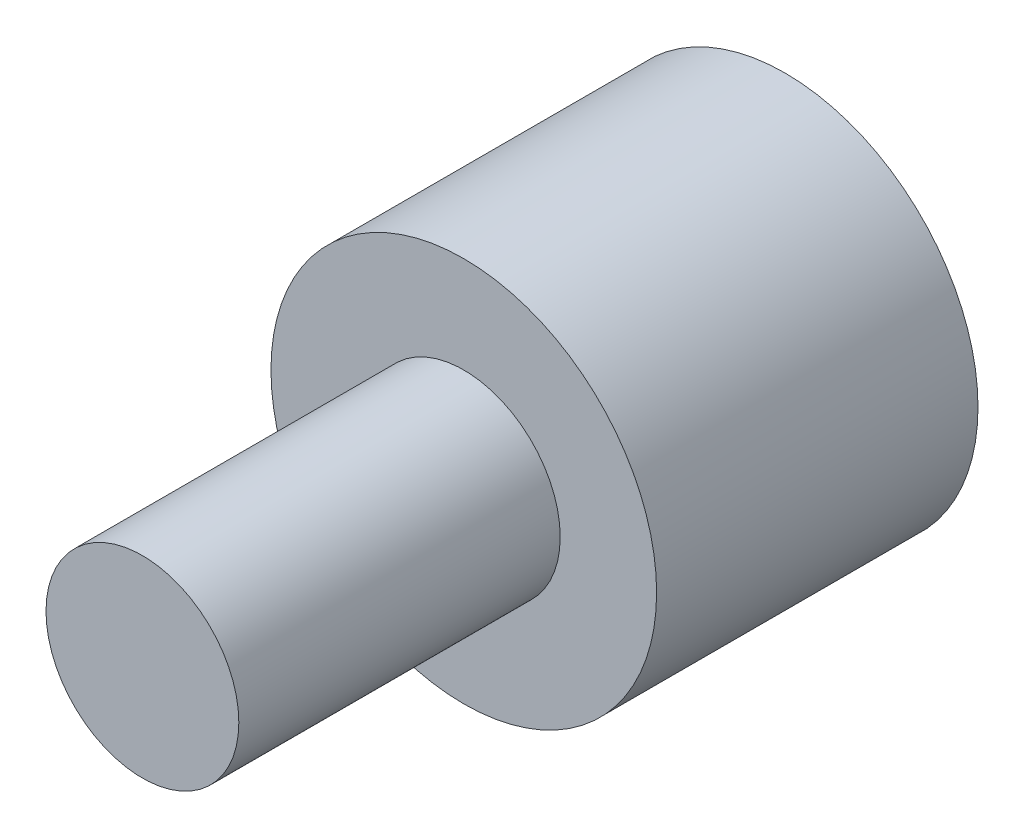
ISO-10303-21;
HEADER;
FILE_DESCRIPTION(('STEP AP214'),'2;1');
FILE_NAME('part.step','',(''),(''),'','','');
FILE_SCHEMA(('AUTOMOTIVE_DESIGN { 1 0 10303 214 1 1 1 1 }'));
ENDSEC;
DATA;
#1=APPLICATION_CONTEXT('core data for automotive mechanical design processes');
#2=APPLICATION_PROTOCOL_DEFINITION('international standard','automotive_design',2000,#1);
#3=PRODUCT_CONTEXT('',#1,'mechanical');
#4=PRODUCT('Part','Part','',(#3));
#5=PRODUCT_RELATED_PRODUCT_CATEGORY('part','',(#4));
#6=PRODUCT_DEFINITION_FORMATION('','',#4);
#7=PRODUCT_DEFINITION_CONTEXT('part definition',#1,'design');
#8=PRODUCT_DEFINITION('design','',#6,#7);
#9=PRODUCT_DEFINITION_SHAPE('','',#8);
#10=(LENGTH_UNIT() NAMED_UNIT(*) SI_UNIT(.MILLI.,.METRE.));
#11=(NAMED_UNIT(*) PLANE_ANGLE_UNIT() SI_UNIT($,.RADIAN.));
#12=(NAMED_UNIT(*) SI_UNIT($,.STERADIAN.) SOLID_ANGLE_UNIT());
#13=UNCERTAINTY_MEASURE_WITH_UNIT(LENGTH_MEASURE(1.E-05),#10,'distance_accuracy_value','');
#14=(GEOMETRIC_REPRESENTATION_CONTEXT(3) GLOBAL_UNCERTAINTY_ASSIGNED_CONTEXT((#13)) GLOBAL_UNIT_ASSIGNED_CONTEXT((#10,
#11,#12)) REPRESENTATION_CONTEXT('',''));
#15=CARTESIAN_POINT('',(0.,0.,0.));
#16=DIRECTION('',(0.,0.,1.));
#17=DIRECTION('',(1.,0.,0.));
#18=AXIS2_PLACEMENT_3D('',#15,#16,#17);
#19=CARTESIAN_POINT('',(0.,0.,20.));
#20=DIRECTION('',(0.,0.,-1.));
#21=DIRECTION('',(-1.,0.,0.));
#22=AXIS2_PLACEMENT_3D('',#19,#20,#21);
#23=CYLINDRICAL_SURFACE('',#22,12.);
#24=CARTESIAN_POINT('',(0.,0.,20.));
#25=DIRECTION('',(0.,0.,1.));
#26=DIRECTION('',(1.,0.,0.));
#27=AXIS2_PLACEMENT_3D('',#24,#25,#26);
#28=CIRCLE('',#27,12.);
#29=CARTESIAN_POINT('',(12.,0.,20.));
#30=VERTEX_POINT('',#29);
#31=EDGE_CURVE('E37',#30,#30,#28,.T.);
#32=ORIENTED_EDGE('',*,*,#31,.F.);
#33=EDGE_LOOP('',(#32));
#34=FACE_BOUND('',#33,.T.);
#35=CARTESIAN_POINT('',(0.,0.,0.));
#36=DIRECTION('',(0.,0.,1.));
#37=DIRECTION('',(1.,0.,0.));
#38=AXIS2_PLACEMENT_3D('',#35,#36,#37);
#39=CIRCLE('',#38,12.);
#40=CARTESIAN_POINT('',(12.,0.,0.));
#41=VERTEX_POINT('',#40);
#42=EDGE_CURVE('E33',#41,#41,#39,.T.);
#43=ORIENTED_EDGE('',*,*,#42,.T.);
#44=EDGE_LOOP('',(#43));
#45=FACE_BOUND('',#44,.T.);
#46=ADVANCED_FACE('F30',(#34,#45),#23,.T.);
#47=CARTESIAN_POINT('',(0.,0.,20.));
#48=DIRECTION('',(0.,0.,1.));
#49=DIRECTION('',(1.,0.,0.));
#50=AXIS2_PLACEMENT_3D('',#47,#48,#49);
#51=PLANE('',#50);
#52=CARTESIAN_POINT('',(0.,0.,20.));
#53=DIRECTION('',(0.,0.,1.));
#54=DIRECTION('',(1.,0.,0.));
#55=AXIS2_PLACEMENT_3D('',#52,#53,#54);
#56=CIRCLE('',#55,6.);
#57=CARTESIAN_POINT('',(6.,0.,20.));
#58=VERTEX_POINT('',#57);
#59=EDGE_CURVE('E10',#58,#58,#56,.T.);
#60=ORIENTED_EDGE('',*,*,#59,.F.);
#61=EDGE_LOOP('',(#60));
#62=FACE_BOUND('',#61,.T.);
#63=ORIENTED_EDGE('',*,*,#31,.T.);
#64=EDGE_LOOP('',(#63));
#65=FACE_BOUND('',#64,.T.);
#66=ADVANCED_FACE('F66',(#62,#65),#51,.T.);
#67=CARTESIAN_POINT('',(0.,0.,0.));
#68=DIRECTION('',(0.,0.,1.));
#69=DIRECTION('',(1.,0.,0.));
#70=AXIS2_PLACEMENT_3D('',#67,#68,#69);
#71=PLANE('',#70);
#72=CARTESIAN_POINT('',(0.,0.,0.));
#73=DIRECTION('',(0.,0.,-1.));
#74=DIRECTION('',(-1.,0.,0.));
#75=AXIS2_PLACEMENT_3D('',#72,#73,#74);
#76=CIRCLE('',#75,5.);
#77=CARTESIAN_POINT('',(-5.,0.,0.));
#78=VERTEX_POINT('',#77);
#79=EDGE_CURVE('E47',#78,#78,#76,.T.);
#80=ORIENTED_EDGE('',*,*,#79,.F.);
#81=EDGE_LOOP('',(#80));
#82=FACE_BOUND('',#81,.T.);
#83=ORIENTED_EDGE('',*,*,#42,.F.);
#84=EDGE_LOOP('',(#83));
#85=FACE_BOUND('',#84,.T.);
#86=ADVANCED_FACE('F62',(#82,#85),#71,.F.);
#87=CARTESIAN_POINT('',(0.,0.,40.));
#88=DIRECTION('',(0.,0.,-1.));
#89=DIRECTION('',(-1.,0.,0.));
#90=AXIS2_PLACEMENT_3D('',#87,#88,#89);
#91=CYLINDRICAL_SURFACE('',#90,6.);
#92=CARTESIAN_POINT('',(0.,0.,40.));
#93=DIRECTION('',(0.,0.,1.));
#94=DIRECTION('',(1.,0.,0.));
#95=AXIS2_PLACEMENT_3D('',#92,#93,#94);
#96=CIRCLE('',#95,6.);
#97=CARTESIAN_POINT('',(6.,0.,40.));
#98=VERTEX_POINT('',#97);
#99=EDGE_CURVE('E43',#98,#98,#96,.T.);
#100=ORIENTED_EDGE('',*,*,#99,.F.);
#101=EDGE_LOOP('',(#100));
#102=FACE_BOUND('',#101,.T.);
#103=ORIENTED_EDGE('',*,*,#59,.T.);
#104=EDGE_LOOP('',(#103));
#105=FACE_BOUND('',#104,.T.);
#106=ADVANCED_FACE('F65',(#102,#105),#91,.T.);
#107=CARTESIAN_POINT('',(0.,0.,40.));
#108=DIRECTION('',(0.,0.,1.));
#109=DIRECTION('',(1.,0.,0.));
#110=AXIS2_PLACEMENT_3D('',#107,#108,#109);
#111=PLANE('',#110);
#112=ORIENTED_EDGE('',*,*,#99,.T.);
#113=EDGE_LOOP('',(#112));
#114=FACE_BOUND('',#113,.T.);
#115=ADVANCED_FACE('F58',(#114),#111,.T.);
#116=CARTESIAN_POINT('',(0.,0.,12.));
#117=DIRECTION('',(0.,0.,-1.));
#118=DIRECTION('',(-1.,0.,0.));
#119=AXIS2_PLACEMENT_3D('',#116,#117,#118);
#120=CYLINDRICAL_SURFACE('',#119,5.);
#121=CARTESIAN_POINT('',(0.,0.,12.));
#122=DIRECTION('',(0.,0.,-1.));
#123=DIRECTION('',(-1.,0.,0.));
#124=AXIS2_PLACEMENT_3D('',#121,#122,#123);
#125=CIRCLE('',#124,5.);
#126=CARTESIAN_POINT('',(-5.,0.,12.));
#127=VERTEX_POINT('',#126);
#128=EDGE_CURVE('E46',#127,#127,#125,.T.);
#129=ORIENTED_EDGE('',*,*,#128,.F.);
#130=EDGE_LOOP('',(#129));
#131=FACE_BOUND('',#130,.T.);
#132=ORIENTED_EDGE('',*,*,#79,.T.);
#133=EDGE_LOOP('',(#132));
#134=FACE_BOUND('',#133,.T.);
#135=ADVANCED_FACE('F55',(#131,#134),#120,.F.);
#136=CARTESIAN_POINT('',(0.,0.,12.));
#137=DIRECTION('',(0.,0.,-1.));
#138=DIRECTION('',(-1.,0.,0.));
#139=AXIS2_PLACEMENT_3D('',#136,#137,#138);
#140=PLANE('',#139);
#141=ORIENTED_EDGE('',*,*,#128,.T.);
#142=EDGE_LOOP('',(#141));
#143=FACE_BOUND('',#142,.T.);
#144=ADVANCED_FACE('F53',(#143),#140,.T.);
#145=CLOSED_SHELL('',(#46,#66,#86,#106,#115,#135,#144));
#146=MANIFOLD_SOLID_BREP('B2',#145);
#147=ADVANCED_BREP_SHAPE_REPRESENTATION('',(#18,#146),#14);
#148=SHAPE_DEFINITION_REPRESENTATION(#9,#147);
ENDSEC;
END-ISO-10303-21;
